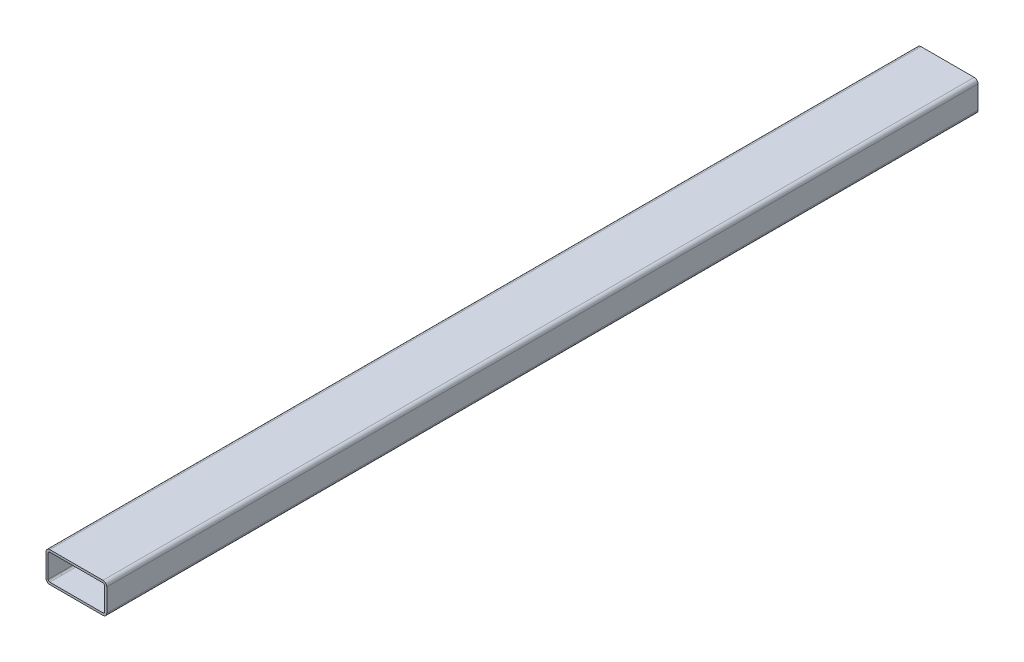
ISO-10303-21;
HEADER;
FILE_DESCRIPTION(('STEP AP214'),'2;1');
FILE_NAME('part.step','',(''),(''),'','','');
FILE_SCHEMA(('AUTOMOTIVE_DESIGN { 1 0 10303 214 1 1 1 1 }'));
ENDSEC;
DATA;
#1=APPLICATION_CONTEXT('core data for automotive mechanical design processes');
#2=APPLICATION_PROTOCOL_DEFINITION('international standard','automotive_design',2000,#1);
#3=PRODUCT_CONTEXT('',#1,'mechanical');
#4=PRODUCT('Part','Part','',(#3));
#5=PRODUCT_RELATED_PRODUCT_CATEGORY('part','',(#4));
#6=PRODUCT_DEFINITION_FORMATION('','',#4);
#7=PRODUCT_DEFINITION_CONTEXT('part definition',#1,'design');
#8=PRODUCT_DEFINITION('design','',#6,#7);
#9=PRODUCT_DEFINITION_SHAPE('','',#8);
#10=(LENGTH_UNIT() NAMED_UNIT(*) SI_UNIT(.MILLI.,.METRE.));
#11=(NAMED_UNIT(*) PLANE_ANGLE_UNIT() SI_UNIT($,.RADIAN.));
#12=(NAMED_UNIT(*) SI_UNIT($,.STERADIAN.) SOLID_ANGLE_UNIT());
#13=UNCERTAINTY_MEASURE_WITH_UNIT(LENGTH_MEASURE(1.E-05),#10,'distance_accuracy_value','');
#14=(GEOMETRIC_REPRESENTATION_CONTEXT(3) GLOBAL_UNCERTAINTY_ASSIGNED_CONTEXT((#13)) GLOBAL_UNIT_ASSIGNED_CONTEXT((#10,
#11,#12)) REPRESENTATION_CONTEXT('',''));
#15=CARTESIAN_POINT('',(0.,0.,0.));
#16=DIRECTION('',(0.,0.,1.));
#17=DIRECTION('',(1.,0.,0.));
#18=AXIS2_PLACEMENT_3D('',#15,#16,#17);
#19=CARTESIAN_POINT('',(35.,-15.,1146.7));
#20=DIRECTION('',(0.,0.,1.));
#21=DIRECTION('',(1.,0.,0.));
#22=AXIS2_PLACEMENT_3D('',#19,#20,#21);
#23=PLANE('',#22);
#24=CARTESIAN_POINT('',(35.,-15.,1146.7));
#25=DIRECTION('',(0.,0.,1.));
#26=DIRECTION('',(1.,0.,0.));
#27=AXIS2_PLACEMENT_3D('',#24,#25,#26);
#28=CIRCLE('',#27,5.);
#29=CARTESIAN_POINT('',(35.,-20.,1146.7));
#30=VERTEX_POINT('',#29);
#31=CARTESIAN_POINT('',(40.,-15.,1146.7));
#32=VERTEX_POINT('',#31);
#33=EDGE_CURVE('E213',#30,#32,#28,.T.);
#34=ORIENTED_EDGE('',*,*,#33,.T.);
#35=DIRECTION('',(0.,1.,0.));
#36=VECTOR('',#35,1.);
#37=CARTESIAN_POINT('',(40.,-15.,1146.7));
#38=LINE('',#37,#36);
#39=CARTESIAN_POINT('',(40.,15.,1146.7));
#40=VERTEX_POINT('',#39);
#41=EDGE_CURVE('E216',#32,#40,#38,.T.);
#42=ORIENTED_EDGE('',*,*,#41,.T.);
#43=CARTESIAN_POINT('',(35.,15.,1146.7));
#44=DIRECTION('',(0.,0.,1.));
#45=DIRECTION('',(-1.,0.,0.));
#46=AXIS2_PLACEMENT_3D('',#43,#44,#45);
#47=CIRCLE('',#46,5.);
#48=CARTESIAN_POINT('',(35.,20.,1146.7));
#49=VERTEX_POINT('',#48);
#50=EDGE_CURVE('E219',#40,#49,#47,.T.);
#51=ORIENTED_EDGE('',*,*,#50,.T.);
#52=DIRECTION('',(-1.,0.,0.));
#53=VECTOR('',#52,1.);
#54=CARTESIAN_POINT('',(-35.,20.,1146.7));
#55=LINE('',#54,#53);
#56=CARTESIAN_POINT('',(-35.,20.,1146.7));
#57=VERTEX_POINT('',#56);
#58=EDGE_CURVE('E221',#49,#57,#55,.T.);
#59=ORIENTED_EDGE('',*,*,#58,.T.);
#60=CARTESIAN_POINT('',(-35.,15.,1146.7));
#61=DIRECTION('',(0.,0.,1.));
#62=DIRECTION('',(-1.,0.,0.));
#63=AXIS2_PLACEMENT_3D('',#60,#61,#62);
#64=CIRCLE('',#63,5.);
#65=CARTESIAN_POINT('',(-40.,15.,1146.7));
#66=VERTEX_POINT('',#65);
#67=EDGE_CURVE('E223',#57,#66,#64,.T.);
#68=ORIENTED_EDGE('',*,*,#67,.T.);
#69=DIRECTION('',(0.,-1.,0.));
#70=VECTOR('',#69,1.);
#71=CARTESIAN_POINT('',(-40.,-15.,1146.7));
#72=LINE('',#71,#70);
#73=CARTESIAN_POINT('',(-40.,-15.,1146.7));
#74=VERTEX_POINT('',#73);
#75=EDGE_CURVE('E225',#66,#74,#72,.T.);
#76=ORIENTED_EDGE('',*,*,#75,.T.);
#77=CARTESIAN_POINT('',(-35.,-15.,1146.7));
#78=DIRECTION('',(0.,0.,1.));
#79=DIRECTION('',(-1.,0.,0.));
#80=AXIS2_PLACEMENT_3D('',#77,#78,#79);
#81=CIRCLE('',#80,5.);
#82=CARTESIAN_POINT('',(-35.,-20.,1146.7));
#83=VERTEX_POINT('',#82);
#84=EDGE_CURVE('E227',#74,#83,#81,.T.);
#85=ORIENTED_EDGE('',*,*,#84,.T.);
#86=DIRECTION('',(1.,0.,0.));
#87=VECTOR('',#86,1.);
#88=CARTESIAN_POINT('',(-35.,-20.,1146.7));
#89=LINE('',#88,#87);
#90=EDGE_CURVE('E229',#83,#30,#89,.T.);
#91=ORIENTED_EDGE('',*,*,#90,.T.);
#92=EDGE_LOOP('',(#34,#42,#51,#59,#68,#76,#85,#91));
#93=FACE_BOUND('',#92,.T.);
#94=DIRECTION('',(1.,0.,0.));
#95=VECTOR('',#94,1.);
#96=CARTESIAN_POINT('',(-35.,-17.1,1146.7));
#97=LINE('',#96,#95);
#98=CARTESIAN_POINT('',(-35.,-17.1,1146.7));
#99=VERTEX_POINT('',#98);
#100=CARTESIAN_POINT('',(35.,-17.1,1146.7));
#101=VERTEX_POINT('',#100);
#102=EDGE_CURVE('E156',#99,#101,#97,.T.);
#103=ORIENTED_EDGE('',*,*,#102,.F.);
#104=CARTESIAN_POINT('',(-35.,-15.,1146.7));
#105=DIRECTION('',(0.,0.,1.));
#106=DIRECTION('',(-1.,0.,0.));
#107=AXIS2_PLACEMENT_3D('',#104,#105,#106);
#108=CIRCLE('',#107,2.1);
#109=CARTESIAN_POINT('',(-37.1,-15.,1146.7));
#110=VERTEX_POINT('',#109);
#111=EDGE_CURVE('E148',#110,#99,#108,.T.);
#112=ORIENTED_EDGE('',*,*,#111,.F.);
#113=DIRECTION('',(0.,-1.,0.));
#114=VECTOR('',#113,1.);
#115=CARTESIAN_POINT('',(-37.1,-15.,1146.7));
#116=LINE('',#115,#114);
#117=CARTESIAN_POINT('',(-37.1,15.,1146.7));
#118=VERTEX_POINT('',#117);
#119=EDGE_CURVE('E181',#118,#110,#116,.T.);
#120=ORIENTED_EDGE('',*,*,#119,.F.);
#121=CARTESIAN_POINT('',(-35.,15.,1146.7));
#122=DIRECTION('',(0.,0.,1.));
#123=DIRECTION('',(-1.,0.,0.));
#124=AXIS2_PLACEMENT_3D('',#121,#122,#123);
#125=CIRCLE('',#124,2.1);
#126=CARTESIAN_POINT('',(-35.,17.1,1146.7));
#127=VERTEX_POINT('',#126);
#128=EDGE_CURVE('E179',#127,#118,#125,.T.);
#129=ORIENTED_EDGE('',*,*,#128,.F.);
#130=DIRECTION('',(-1.,0.,0.));
#131=VECTOR('',#130,1.);
#132=CARTESIAN_POINT('',(-35.,17.1,1146.7));
#133=LINE('',#132,#131);
#134=CARTESIAN_POINT('',(35.,17.1,1146.7));
#135=VERTEX_POINT('',#134);
#136=EDGE_CURVE('E177',#135,#127,#133,.T.);
#137=ORIENTED_EDGE('',*,*,#136,.F.);
#138=CARTESIAN_POINT('',(35.,15.,1146.7));
#139=DIRECTION('',(0.,0.,1.));
#140=DIRECTION('',(-1.,0.,0.));
#141=AXIS2_PLACEMENT_3D('',#138,#139,#140);
#142=CIRCLE('',#141,2.1);
#143=CARTESIAN_POINT('',(37.1,15.,1146.7));
#144=VERTEX_POINT('',#143);
#145=EDGE_CURVE('E175',#144,#135,#142,.T.);
#146=ORIENTED_EDGE('',*,*,#145,.F.);
#147=DIRECTION('',(0.,1.,0.));
#148=VECTOR('',#147,1.);
#149=CARTESIAN_POINT('',(37.1,-15.,1146.7));
#150=LINE('',#149,#148);
#151=CARTESIAN_POINT('',(37.1,-15.,1146.7));
#152=VERTEX_POINT('',#151);
#153=EDGE_CURVE('E171',#152,#144,#150,.T.);
#154=ORIENTED_EDGE('',*,*,#153,.F.);
#155=CARTESIAN_POINT('',(35.,-15.,1146.7));
#156=DIRECTION('',(0.,0.,1.));
#157=DIRECTION('',(1.,0.,0.));
#158=AXIS2_PLACEMENT_3D('',#155,#156,#157);
#159=CIRCLE('',#158,2.1);
#160=EDGE_CURVE('E169',#101,#152,#159,.T.);
#161=ORIENTED_EDGE('',*,*,#160,.F.);
#162=EDGE_LOOP('',(#103,#112,#120,#129,#137,#146,#154,#161));
#163=FACE_BOUND('',#162,.T.);
#164=ADVANCED_FACE('F35',(#93,#163),#23,.T.);
#165=CARTESIAN_POINT('',(35.,-15.,0.));
#166=DIRECTION('',(0.,0.,1.));
#167=DIRECTION('',(1.,0.,0.));
#168=AXIS2_PLACEMENT_3D('',#165,#166,#167);
#169=PLANE('',#168);
#170=CARTESIAN_POINT('',(35.,-15.,0.));
#171=DIRECTION('',(0.,0.,1.));
#172=DIRECTION('',(1.,0.,0.));
#173=AXIS2_PLACEMENT_3D('',#170,#171,#172);
#174=CIRCLE('',#173,5.);
#175=CARTESIAN_POINT('',(35.,-20.,0.));
#176=VERTEX_POINT('',#175);
#177=CARTESIAN_POINT('',(40.,-15.,0.));
#178=VERTEX_POINT('',#177);
#179=EDGE_CURVE('E164',#176,#178,#174,.T.);
#180=ORIENTED_EDGE('',*,*,#179,.F.);
#181=DIRECTION('',(1.,0.,0.));
#182=VECTOR('',#181,1.);
#183=CARTESIAN_POINT('',(-35.,-20.,0.));
#184=LINE('',#183,#182);
#185=CARTESIAN_POINT('',(-35.,-20.,0.));
#186=VERTEX_POINT('',#185);
#187=EDGE_CURVE('E217',#186,#176,#184,.T.);
#188=ORIENTED_EDGE('',*,*,#187,.F.);
#189=CARTESIAN_POINT('',(-35.,-15.,0.));
#190=DIRECTION('',(0.,0.,1.));
#191=DIRECTION('',(-1.,0.,0.));
#192=AXIS2_PLACEMENT_3D('',#189,#190,#191);
#193=CIRCLE('',#192,5.);
#194=CARTESIAN_POINT('',(-40.,-15.,0.));
#195=VERTEX_POINT('',#194);
#196=EDGE_CURVE('E244',#195,#186,#193,.T.);
#197=ORIENTED_EDGE('',*,*,#196,.F.);
#198=DIRECTION('',(0.,-1.,0.));
#199=VECTOR('',#198,1.);
#200=CARTESIAN_POINT('',(-40.,-15.,0.));
#201=LINE('',#200,#199);
#202=CARTESIAN_POINT('',(-40.,15.,0.));
#203=VERTEX_POINT('',#202);
#204=EDGE_CURVE('E242',#203,#195,#201,.T.);
#205=ORIENTED_EDGE('',*,*,#204,.F.);
#206=CARTESIAN_POINT('',(-35.,15.,0.));
#207=DIRECTION('',(0.,0.,1.));
#208=DIRECTION('',(-1.,0.,0.));
#209=AXIS2_PLACEMENT_3D('',#206,#207,#208);
#210=CIRCLE('',#209,5.);
#211=CARTESIAN_POINT('',(-35.,20.,0.));
#212=VERTEX_POINT('',#211);
#213=EDGE_CURVE('E240',#212,#203,#210,.T.);
#214=ORIENTED_EDGE('',*,*,#213,.F.);
#215=DIRECTION('',(-1.,0.,0.));
#216=VECTOR('',#215,1.);
#217=CARTESIAN_POINT('',(-35.,20.,0.));
#218=LINE('',#217,#216);
#219=CARTESIAN_POINT('',(35.,20.,0.));
#220=VERTEX_POINT('',#219);
#221=EDGE_CURVE('E238',#220,#212,#218,.T.);
#222=ORIENTED_EDGE('',*,*,#221,.F.);
#223=CARTESIAN_POINT('',(35.,15.,0.));
#224=DIRECTION('',(0.,0.,1.));
#225=DIRECTION('',(-1.,0.,0.));
#226=AXIS2_PLACEMENT_3D('',#223,#224,#225);
#227=CIRCLE('',#226,5.);
#228=CARTESIAN_POINT('',(40.,15.,0.));
#229=VERTEX_POINT('',#228);
#230=EDGE_CURVE('E236',#229,#220,#227,.T.);
#231=ORIENTED_EDGE('',*,*,#230,.F.);
#232=DIRECTION('',(0.,1.,0.));
#233=VECTOR('',#232,1.);
#234=CARTESIAN_POINT('',(40.,-15.,0.));
#235=LINE('',#234,#233);
#236=EDGE_CURVE('E234',#178,#229,#235,.T.);
#237=ORIENTED_EDGE('',*,*,#236,.F.);
#238=EDGE_LOOP('',(#180,#188,#197,#205,#214,#222,#231,#237));
#239=FACE_BOUND('',#238,.T.);
#240=CARTESIAN_POINT('',(-35.,-15.,0.));
#241=DIRECTION('',(0.,0.,1.));
#242=DIRECTION('',(-1.,0.,0.));
#243=AXIS2_PLACEMENT_3D('',#240,#241,#242);
#244=CIRCLE('',#243,2.1);
#245=CARTESIAN_POINT('',(-37.1,-15.,0.));
#246=VERTEX_POINT('',#245);
#247=CARTESIAN_POINT('',(-35.,-17.1,0.));
#248=VERTEX_POINT('',#247);
#249=EDGE_CURVE('E58',#246,#248,#244,.T.);
#250=ORIENTED_EDGE('',*,*,#249,.T.);
#251=DIRECTION('',(1.,0.,0.));
#252=VECTOR('',#251,1.);
#253=CARTESIAN_POINT('',(-35.,-17.1,0.));
#254=LINE('',#253,#252);
#255=CARTESIAN_POINT('',(35.,-17.1,0.));
#256=VERTEX_POINT('',#255);
#257=EDGE_CURVE('E163',#248,#256,#254,.T.);
#258=ORIENTED_EDGE('',*,*,#257,.T.);
#259=CARTESIAN_POINT('',(35.,-15.,0.));
#260=DIRECTION('',(0.,0.,1.));
#261=DIRECTION('',(1.,0.,0.));
#262=AXIS2_PLACEMENT_3D('',#259,#260,#261);
#263=CIRCLE('',#262,2.1);
#264=CARTESIAN_POINT('',(37.1,-15.,0.));
#265=VERTEX_POINT('',#264);
#266=EDGE_CURVE('E185',#256,#265,#263,.T.);
#267=ORIENTED_EDGE('',*,*,#266,.T.);
#268=DIRECTION('',(0.,1.,0.));
#269=VECTOR('',#268,1.);
#270=CARTESIAN_POINT('',(37.1,-15.,0.));
#271=LINE('',#270,#269);
#272=CARTESIAN_POINT('',(37.1,15.,0.));
#273=VERTEX_POINT('',#272);
#274=EDGE_CURVE('E188',#265,#273,#271,.T.);
#275=ORIENTED_EDGE('',*,*,#274,.T.);
#276=CARTESIAN_POINT('',(35.,15.,0.));
#277=DIRECTION('',(0.,0.,1.));
#278=DIRECTION('',(-1.,0.,0.));
#279=AXIS2_PLACEMENT_3D('',#276,#277,#278);
#280=CIRCLE('',#279,2.1);
#281=CARTESIAN_POINT('',(35.,17.1,0.));
#282=VERTEX_POINT('',#281);
#283=EDGE_CURVE('E191',#273,#282,#280,.T.);
#284=ORIENTED_EDGE('',*,*,#283,.T.);
#285=DIRECTION('',(-1.,0.,0.));
#286=VECTOR('',#285,1.);
#287=CARTESIAN_POINT('',(-35.,17.1,0.));
#288=LINE('',#287,#286);
#289=CARTESIAN_POINT('',(-35.,17.1,0.));
#290=VERTEX_POINT('',#289);
#291=EDGE_CURVE('E194',#282,#290,#288,.T.);
#292=ORIENTED_EDGE('',*,*,#291,.T.);
#293=CARTESIAN_POINT('',(-35.,15.,0.));
#294=DIRECTION('',(0.,0.,1.));
#295=DIRECTION('',(-1.,0.,0.));
#296=AXIS2_PLACEMENT_3D('',#293,#294,#295);
#297=CIRCLE('',#296,2.1);
#298=CARTESIAN_POINT('',(-37.1,15.,0.));
#299=VERTEX_POINT('',#298);
#300=EDGE_CURVE('E197',#290,#299,#297,.T.);
#301=ORIENTED_EDGE('',*,*,#300,.T.);
#302=DIRECTION('',(0.,-1.,0.));
#303=VECTOR('',#302,1.);
#304=CARTESIAN_POINT('',(-37.1,-15.,0.));
#305=LINE('',#304,#303);
#306=EDGE_CURVE('E157',#299,#246,#305,.T.);
#307=ORIENTED_EDGE('',*,*,#306,.T.);
#308=EDGE_LOOP('',(#250,#258,#267,#275,#284,#292,#301,#307));
#309=FACE_BOUND('',#308,.T.);
#310=ADVANCED_FACE('F274',(#239,#309),#169,.F.);
#311=CARTESIAN_POINT('',(35.,-15.,1146.7));
#312=DIRECTION('',(0.,0.,-1.));
#313=DIRECTION('',(-1.,0.,0.));
#314=AXIS2_PLACEMENT_3D('',#311,#312,#313);
#315=CYLINDRICAL_SURFACE('',#314,5.);
#316=ORIENTED_EDGE('',*,*,#179,.T.);
#317=DIRECTION('',(0.,0.,-1.));
#318=VECTOR('',#317,1.);
#319=CARTESIAN_POINT('',(40.,-15.,1146.7));
#320=LINE('',#319,#318);
#321=EDGE_CURVE('E11',#32,#178,#320,.T.);
#322=ORIENTED_EDGE('',*,*,#321,.F.);
#323=ORIENTED_EDGE('',*,*,#33,.F.);
#324=DIRECTION('',(0.,0.,-1.));
#325=VECTOR('',#324,1.);
#326=CARTESIAN_POINT('',(35.,-20.,1146.7));
#327=LINE('',#326,#325);
#328=EDGE_CURVE('E231',#30,#176,#327,.T.);
#329=ORIENTED_EDGE('',*,*,#328,.T.);
#330=EDGE_LOOP('',(#316,#322,#323,#329));
#331=FACE_BOUND('',#330,.T.);
#332=ADVANCED_FACE('F37',(#331),#315,.T.);
#333=CARTESIAN_POINT('',(40.,-15.,1146.7));
#334=DIRECTION('',(-1.,0.,0.));
#335=DIRECTION('',(0.,0.,1.));
#336=AXIS2_PLACEMENT_3D('',#333,#334,#335);
#337=PLANE('',#336);
#338=ORIENTED_EDGE('',*,*,#236,.T.);
#339=DIRECTION('',(0.,0.,-1.));
#340=VECTOR('',#339,1.);
#341=CARTESIAN_POINT('',(40.,15.,1146.7));
#342=LINE('',#341,#340);
#343=EDGE_CURVE('E43',#40,#229,#342,.T.);
#344=ORIENTED_EDGE('',*,*,#343,.F.);
#345=ORIENTED_EDGE('',*,*,#41,.F.);
#346=ORIENTED_EDGE('',*,*,#321,.T.);
#347=EDGE_LOOP('',(#338,#344,#345,#346));
#348=FACE_BOUND('',#347,.T.);
#349=ADVANCED_FACE('F291',(#348),#337,.F.);
#350=CARTESIAN_POINT('',(35.,15.,1146.7));
#351=DIRECTION('',(0.,0.,-1.));
#352=DIRECTION('',(-1.,0.,0.));
#353=AXIS2_PLACEMENT_3D('',#350,#351,#352);
#354=CYLINDRICAL_SURFACE('',#353,5.);
#355=ORIENTED_EDGE('',*,*,#230,.T.);
#356=DIRECTION('',(0.,0.,-1.));
#357=VECTOR('',#356,1.);
#358=CARTESIAN_POINT('',(35.,20.,1146.7));
#359=LINE('',#358,#357);
#360=EDGE_CURVE('E261',#49,#220,#359,.T.);
#361=ORIENTED_EDGE('',*,*,#360,.F.);
#362=ORIENTED_EDGE('',*,*,#50,.F.);
#363=ORIENTED_EDGE('',*,*,#343,.T.);
#364=EDGE_LOOP('',(#355,#361,#362,#363));
#365=FACE_BOUND('',#364,.T.);
#366=ADVANCED_FACE('F268',(#365),#354,.T.);
#367=CARTESIAN_POINT('',(-35.,20.,1146.7));
#368=DIRECTION('',(0.,-1.,0.));
#369=DIRECTION('',(0.,0.,-1.));
#370=AXIS2_PLACEMENT_3D('',#367,#368,#369);
#371=PLANE('',#370);
#372=ORIENTED_EDGE('',*,*,#221,.T.);
#373=DIRECTION('',(0.,0.,-1.));
#374=VECTOR('',#373,1.);
#375=CARTESIAN_POINT('',(-35.,20.,1146.7));
#376=LINE('',#375,#374);
#377=EDGE_CURVE('E258',#57,#212,#376,.T.);
#378=ORIENTED_EDGE('',*,*,#377,.F.);
#379=ORIENTED_EDGE('',*,*,#58,.F.);
#380=ORIENTED_EDGE('',*,*,#360,.T.);
#381=EDGE_LOOP('',(#372,#378,#379,#380));
#382=FACE_BOUND('',#381,.T.);
#383=ADVANCED_FACE('F280',(#382),#371,.F.);
#384=CARTESIAN_POINT('',(-35.,15.,1146.7));
#385=DIRECTION('',(0.,0.,-1.));
#386=DIRECTION('',(-1.,0.,0.));
#387=AXIS2_PLACEMENT_3D('',#384,#385,#386);
#388=CYLINDRICAL_SURFACE('',#387,5.);
#389=ORIENTED_EDGE('',*,*,#213,.T.);
#390=DIRECTION('',(0.,0.,-1.));
#391=VECTOR('',#390,1.);
#392=CARTESIAN_POINT('',(-40.,15.,1146.7));
#393=LINE('',#392,#391);
#394=EDGE_CURVE('E255',#66,#203,#393,.T.);
#395=ORIENTED_EDGE('',*,*,#394,.F.);
#396=ORIENTED_EDGE('',*,*,#67,.F.);
#397=ORIENTED_EDGE('',*,*,#377,.T.);
#398=EDGE_LOOP('',(#389,#395,#396,#397));
#399=FACE_BOUND('',#398,.T.);
#400=ADVANCED_FACE('F284',(#399),#388,.T.);
#401=CARTESIAN_POINT('',(-40.,-15.,1146.7));
#402=DIRECTION('',(1.,0.,0.));
#403=DIRECTION('',(0.,0.,-1.));
#404=AXIS2_PLACEMENT_3D('',#401,#402,#403);
#405=PLANE('',#404);
#406=ORIENTED_EDGE('',*,*,#204,.T.);
#407=DIRECTION('',(0.,0.,-1.));
#408=VECTOR('',#407,1.);
#409=CARTESIAN_POINT('',(-40.,-15.,1146.7));
#410=LINE('',#409,#408);
#411=EDGE_CURVE('E252',#74,#195,#410,.T.);
#412=ORIENTED_EDGE('',*,*,#411,.F.);
#413=ORIENTED_EDGE('',*,*,#75,.F.);
#414=ORIENTED_EDGE('',*,*,#394,.T.);
#415=EDGE_LOOP('',(#406,#412,#413,#414));
#416=FACE_BOUND('',#415,.T.);
#417=ADVANCED_FACE('F304',(#416),#405,.F.);
#418=CARTESIAN_POINT('',(-35.,-15.,1146.7));
#419=DIRECTION('',(0.,0.,-1.));
#420=DIRECTION('',(-1.,0.,0.));
#421=AXIS2_PLACEMENT_3D('',#418,#419,#420);
#422=CYLINDRICAL_SURFACE('',#421,5.);
#423=ORIENTED_EDGE('',*,*,#196,.T.);
#424=DIRECTION('',(0.,0.,-1.));
#425=VECTOR('',#424,1.);
#426=CARTESIAN_POINT('',(-35.,-20.,1146.7));
#427=LINE('',#426,#425);
#428=EDGE_CURVE('E249',#83,#186,#427,.T.);
#429=ORIENTED_EDGE('',*,*,#428,.F.);
#430=ORIENTED_EDGE('',*,*,#84,.F.);
#431=ORIENTED_EDGE('',*,*,#411,.T.);
#432=EDGE_LOOP('',(#423,#429,#430,#431));
#433=FACE_BOUND('',#432,.T.);
#434=ADVANCED_FACE('F302',(#433),#422,.T.);
#435=CARTESIAN_POINT('',(-35.,-20.,1146.7));
#436=DIRECTION('',(0.,1.,0.));
#437=DIRECTION('',(-1.,0.,0.));
#438=AXIS2_PLACEMENT_3D('',#435,#436,#437);
#439=PLANE('',#438);
#440=ORIENTED_EDGE('',*,*,#187,.T.);
#441=ORIENTED_EDGE('',*,*,#328,.F.);
#442=ORIENTED_EDGE('',*,*,#90,.F.);
#443=ORIENTED_EDGE('',*,*,#428,.T.);
#444=EDGE_LOOP('',(#440,#441,#442,#443));
#445=FACE_BOUND('',#444,.T.);
#446=ADVANCED_FACE('F297',(#445),#439,.F.);
#447=CARTESIAN_POINT('',(-35.,-15.,1146.7));
#448=DIRECTION('',(0.,0.,-1.));
#449=DIRECTION('',(-1.,0.,0.));
#450=AXIS2_PLACEMENT_3D('',#447,#448,#449);
#451=CYLINDRICAL_SURFACE('',#450,2.1);
#452=ORIENTED_EDGE('',*,*,#249,.F.);
#453=DIRECTION('',(0.,0.,-1.));
#454=VECTOR('',#453,1.);
#455=CARTESIAN_POINT('',(-37.1,-15.,1146.7));
#456=LINE('',#455,#454);
#457=EDGE_CURVE('E152',#110,#246,#456,.T.);
#458=ORIENTED_EDGE('',*,*,#457,.F.);
#459=ORIENTED_EDGE('',*,*,#111,.T.);
#460=DIRECTION('',(0.,0.,-1.));
#461=VECTOR('',#460,1.);
#462=CARTESIAN_POINT('',(-35.,-17.1,1146.7));
#463=LINE('',#462,#461);
#464=EDGE_CURVE('E151',#99,#248,#463,.T.);
#465=ORIENTED_EDGE('',*,*,#464,.T.);
#466=EDGE_LOOP('',(#452,#458,#459,#465));
#467=FACE_BOUND('',#466,.T.);
#468=ADVANCED_FACE('F150',(#467),#451,.F.);
#469=CARTESIAN_POINT('',(-35.,-17.1,1146.7));
#470=DIRECTION('',(0.,1.,0.));
#471=DIRECTION('',(0.,0.,1.));
#472=AXIS2_PLACEMENT_3D('',#469,#470,#471);
#473=PLANE('',#472);
#474=ORIENTED_EDGE('',*,*,#257,.F.);
#475=ORIENTED_EDGE('',*,*,#464,.F.);
#476=ORIENTED_EDGE('',*,*,#102,.T.);
#477=DIRECTION('',(0.,0.,-1.));
#478=VECTOR('',#477,1.);
#479=CARTESIAN_POINT('',(35.,-17.1,1146.7));
#480=LINE('',#479,#478);
#481=EDGE_CURVE('E165',#101,#256,#480,.T.);
#482=ORIENTED_EDGE('',*,*,#481,.T.);
#483=EDGE_LOOP('',(#474,#475,#476,#482));
#484=FACE_BOUND('',#483,.T.);
#485=ADVANCED_FACE('F160',(#484),#473,.T.);
#486=CARTESIAN_POINT('',(35.,-15.,1146.7));
#487=DIRECTION('',(0.,0.,-1.));
#488=DIRECTION('',(-1.,0.,0.));
#489=AXIS2_PLACEMENT_3D('',#486,#487,#488);
#490=CYLINDRICAL_SURFACE('',#489,2.1);
#491=ORIENTED_EDGE('',*,*,#266,.F.);
#492=ORIENTED_EDGE('',*,*,#481,.F.);
#493=ORIENTED_EDGE('',*,*,#160,.T.);
#494=DIRECTION('',(0.,0.,-1.));
#495=VECTOR('',#494,1.);
#496=CARTESIAN_POINT('',(37.1,-15.,1146.7));
#497=LINE('',#496,#495);
#498=EDGE_CURVE('E210',#152,#265,#497,.T.);
#499=ORIENTED_EDGE('',*,*,#498,.T.);
#500=EDGE_LOOP('',(#491,#492,#493,#499));
#501=FACE_BOUND('',#500,.T.);
#502=ADVANCED_FACE('F329',(#501),#490,.F.);
#503=CARTESIAN_POINT('',(37.1,-15.,1146.7));
#504=DIRECTION('',(-1.,0.,0.));
#505=DIRECTION('',(0.,0.,1.));
#506=AXIS2_PLACEMENT_3D('',#503,#504,#505);
#507=PLANE('',#506);
#508=ORIENTED_EDGE('',*,*,#274,.F.);
#509=ORIENTED_EDGE('',*,*,#498,.F.);
#510=ORIENTED_EDGE('',*,*,#153,.T.);
#511=DIRECTION('',(0.,0.,-1.));
#512=VECTOR('',#511,1.);
#513=CARTESIAN_POINT('',(37.1,15.,1146.7));
#514=LINE('',#513,#512);
#515=EDGE_CURVE('E208',#144,#273,#514,.T.);
#516=ORIENTED_EDGE('',*,*,#515,.T.);
#517=EDGE_LOOP('',(#508,#509,#510,#516));
#518=FACE_BOUND('',#517,.T.);
#519=ADVANCED_FACE('F333',(#518),#507,.T.);
#520=CARTESIAN_POINT('',(35.,15.,1146.7));
#521=DIRECTION('',(0.,0.,-1.));
#522=DIRECTION('',(-1.,0.,0.));
#523=AXIS2_PLACEMENT_3D('',#520,#521,#522);
#524=CYLINDRICAL_SURFACE('',#523,2.1);
#525=ORIENTED_EDGE('',*,*,#283,.F.);
#526=ORIENTED_EDGE('',*,*,#515,.F.);
#527=ORIENTED_EDGE('',*,*,#145,.T.);
#528=DIRECTION('',(0.,0.,-1.));
#529=VECTOR('',#528,1.);
#530=CARTESIAN_POINT('',(35.,17.1,1146.7));
#531=LINE('',#530,#529);
#532=EDGE_CURVE('E206',#135,#282,#531,.T.);
#533=ORIENTED_EDGE('',*,*,#532,.T.);
#534=EDGE_LOOP('',(#525,#526,#527,#533));
#535=FACE_BOUND('',#534,.T.);
#536=ADVANCED_FACE('F339',(#535),#524,.F.);
#537=CARTESIAN_POINT('',(-35.,17.1,1146.7));
#538=DIRECTION('',(0.,-1.,0.));
#539=DIRECTION('',(0.,0.,-1.));
#540=AXIS2_PLACEMENT_3D('',#537,#538,#539);
#541=PLANE('',#540);
#542=ORIENTED_EDGE('',*,*,#291,.F.);
#543=ORIENTED_EDGE('',*,*,#532,.F.);
#544=ORIENTED_EDGE('',*,*,#136,.T.);
#545=DIRECTION('',(0.,0.,-1.));
#546=VECTOR('',#545,1.);
#547=CARTESIAN_POINT('',(-35.,17.1,1146.7));
#548=LINE('',#547,#546);
#549=EDGE_CURVE('E204',#127,#290,#548,.T.);
#550=ORIENTED_EDGE('',*,*,#549,.T.);
#551=EDGE_LOOP('',(#542,#543,#544,#550));
#552=FACE_BOUND('',#551,.T.);
#553=ADVANCED_FACE('F343',(#552),#541,.T.);
#554=CARTESIAN_POINT('',(-35.,15.,1146.7));
#555=DIRECTION('',(0.,0.,-1.));
#556=DIRECTION('',(-1.,0.,0.));
#557=AXIS2_PLACEMENT_3D('',#554,#555,#556);
#558=CYLINDRICAL_SURFACE('',#557,2.1);
#559=ORIENTED_EDGE('',*,*,#300,.F.);
#560=ORIENTED_EDGE('',*,*,#549,.F.);
#561=ORIENTED_EDGE('',*,*,#128,.T.);
#562=DIRECTION('',(0.,0.,-1.));
#563=VECTOR('',#562,1.);
#564=CARTESIAN_POINT('',(-37.1,15.,1146.7));
#565=LINE('',#564,#563);
#566=EDGE_CURVE('E50',#118,#299,#565,.T.);
#567=ORIENTED_EDGE('',*,*,#566,.T.);
#568=EDGE_LOOP('',(#559,#560,#561,#567));
#569=FACE_BOUND('',#568,.T.);
#570=ADVANCED_FACE('F347',(#569),#558,.F.);
#571=CARTESIAN_POINT('',(-37.1,-15.,1146.7));
#572=DIRECTION('',(1.,0.,0.));
#573=DIRECTION('',(0.,0.,-1.));
#574=AXIS2_PLACEMENT_3D('',#571,#572,#573);
#575=PLANE('',#574);
#576=ORIENTED_EDGE('',*,*,#306,.F.);
#577=ORIENTED_EDGE('',*,*,#566,.F.);
#578=ORIENTED_EDGE('',*,*,#119,.T.);
#579=ORIENTED_EDGE('',*,*,#457,.T.);
#580=EDGE_LOOP('',(#576,#577,#578,#579));
#581=FACE_BOUND('',#580,.T.);
#582=ADVANCED_FACE('F351',(#581),#575,.T.);
#583=CLOSED_SHELL('',(#164,#310,#332,#349,#366,#383,#400,#417,#434,#446,#468,#485,#502,#519,
#536,#553,#570,#582));
#584=MANIFOLD_SOLID_BREP('B2',#583);
#585=ADVANCED_BREP_SHAPE_REPRESENTATION('',(#18,#584),#14);
#586=SHAPE_DEFINITION_REPRESENTATION(#9,#585);
ENDSEC;
END-ISO-10303-21;
